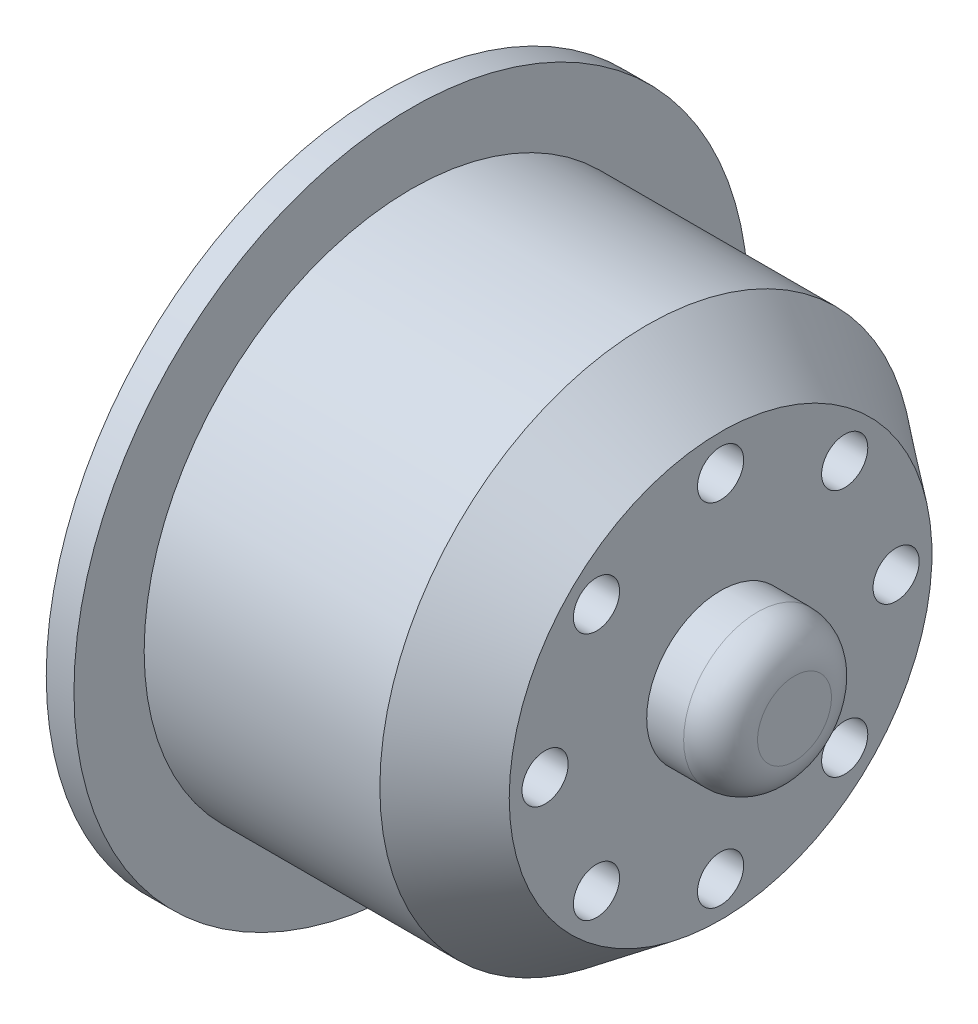
ISO-10303-21;
HEADER;
FILE_DESCRIPTION(('STEP AP214'),'2;1');
FILE_NAME('part.step','',(''),(''),'','','');
FILE_SCHEMA(('AUTOMOTIVE_DESIGN { 1 0 10303 214 1 1 1 1 }'));
ENDSEC;
DATA;
#1=APPLICATION_CONTEXT('core data for automotive mechanical design processes');
#2=APPLICATION_PROTOCOL_DEFINITION('international standard','automotive_design',2000,#1);
#3=PRODUCT_CONTEXT('',#1,'mechanical');
#4=PRODUCT('Part','Part','',(#3));
#5=PRODUCT_RELATED_PRODUCT_CATEGORY('part','',(#4));
#6=PRODUCT_DEFINITION_FORMATION('','',#4);
#7=PRODUCT_DEFINITION_CONTEXT('part definition',#1,'design');
#8=PRODUCT_DEFINITION('design','',#6,#7);
#9=PRODUCT_DEFINITION_SHAPE('','',#8);
#10=(LENGTH_UNIT() NAMED_UNIT(*) SI_UNIT(.MILLI.,.METRE.));
#11=(NAMED_UNIT(*) PLANE_ANGLE_UNIT() SI_UNIT($,.RADIAN.));
#12=(NAMED_UNIT(*) SI_UNIT($,.STERADIAN.) SOLID_ANGLE_UNIT());
#13=UNCERTAINTY_MEASURE_WITH_UNIT(LENGTH_MEASURE(1.E-05),#10,'distance_accuracy_value','');
#14=(GEOMETRIC_REPRESENTATION_CONTEXT(3) GLOBAL_UNCERTAINTY_ASSIGNED_CONTEXT((#13)) GLOBAL_UNIT_ASSIGNED_CONTEXT((#10,
#11,#12)) REPRESENTATION_CONTEXT('',''));
#15=CARTESIAN_POINT('',(0.,0.,0.));
#16=DIRECTION('',(0.,0.,1.));
#17=DIRECTION('',(1.,0.,0.));
#18=AXIS2_PLACEMENT_3D('',#15,#16,#17);
#19=CARTESIAN_POINT('',(-7.6304347826087,6.71751442127166,6.71751442127198));
#20=DIRECTION('',(1.,0.,0.));
#21=DIRECTION('',(0.,0.,-1.));
#22=AXIS2_PLACEMENT_3D('',#19,#20,#21);
#23=CYLINDRICAL_SURFACE('',#22,1.25);
#24=CARTESIAN_POINT('',(10.6195652173913,6.71751442127166,6.71751442127198));
#25=DIRECTION('',(1.,0.,0.));
#26=DIRECTION('',(0.,0.,-1.));
#27=AXIS2_PLACEMENT_3D('',#24,#25,#26);
#28=CIRCLE('',#27,1.25);
#29=CARTESIAN_POINT('',(10.6195652173913,6.71751442127166,5.46751442127198));
#30=VERTEX_POINT('',#29);
#31=EDGE_CURVE('E271',#30,#30,#28,.T.);
#32=ORIENTED_EDGE('',*,*,#31,.T.);
#33=EDGE_LOOP('',(#32));
#34=FACE_BOUND('',#33,.T.);
#35=CARTESIAN_POINT('',(5.61956521739131,6.71751442127166,6.71751442127198));
#36=DIRECTION('',(-1.,0.,0.));
#37=DIRECTION('',(0.,0.,1.));
#38=AXIS2_PLACEMENT_3D('',#35,#36,#37);
#39=CIRCLE('',#38,1.25);
#40=CARTESIAN_POINT('',(5.61956521739131,6.71751442127166,7.96751442127198));
#41=VERTEX_POINT('',#40);
#42=EDGE_CURVE('E275',#41,#41,#39,.F.);
#43=ORIENTED_EDGE('',*,*,#42,.F.);
#44=EDGE_LOOP('',(#43));
#45=FACE_BOUND('',#44,.T.);
#46=ADVANCED_FACE('F41',(#34,#45),#23,.F.);
#47=CARTESIAN_POINT('',(-7.6304347826087,-7.66926912071228E-13,9.49999999999923));
#48=DIRECTION('',(1.,0.,0.));
#49=DIRECTION('',(0.,0.,-1.));
#50=AXIS2_PLACEMENT_3D('',#47,#48,#49);
#51=CYLINDRICAL_SURFACE('',#50,1.25);
#52=CARTESIAN_POINT('',(10.6195652173913,-7.66926912071228E-13,9.49999999999923));
#53=DIRECTION('',(1.,0.,0.));
#54=DIRECTION('',(0.,0.,-1.));
#55=AXIS2_PLACEMENT_3D('',#52,#53,#54);
#56=CIRCLE('',#55,1.25);
#57=CARTESIAN_POINT('',(10.6195652173913,-7.66926912071228E-13,8.24999999999924));
#58=VERTEX_POINT('',#57);
#59=EDGE_CURVE('E267',#58,#58,#56,.T.);
#60=ORIENTED_EDGE('',*,*,#59,.T.);
#61=EDGE_LOOP('',(#60));
#62=FACE_BOUND('',#61,.T.);
#63=CARTESIAN_POINT('',(5.61956521739131,-7.66926912071228E-13,9.49999999999923));
#64=DIRECTION('',(-1.,0.,0.));
#65=DIRECTION('',(0.,0.,1.));
#66=AXIS2_PLACEMENT_3D('',#63,#64,#65);
#67=CIRCLE('',#66,1.25);
#68=CARTESIAN_POINT('',(5.61956521739131,-7.66926912071228E-13,10.7499999999992));
#69=VERTEX_POINT('',#68);
#70=EDGE_CURVE('E331',#69,#69,#67,.F.);
#71=ORIENTED_EDGE('',*,*,#70,.F.);
#72=EDGE_LOOP('',(#71));
#73=FACE_BOUND('',#72,.T.);
#74=ADVANCED_FACE('F438',(#62,#73),#51,.F.);
#75=CARTESIAN_POINT('',(-7.6304347826087,-6.71751442127274,6.7175144212709));
#76=DIRECTION('',(1.,0.,0.));
#77=DIRECTION('',(0.,0.,-1.));
#78=AXIS2_PLACEMENT_3D('',#75,#76,#77);
#79=CYLINDRICAL_SURFACE('',#78,1.25);
#80=CARTESIAN_POINT('',(10.6195652173913,-6.71751442127274,6.7175144212709));
#81=DIRECTION('',(1.,0.,0.));
#82=DIRECTION('',(0.,0.,-1.));
#83=AXIS2_PLACEMENT_3D('',#80,#81,#82);
#84=CIRCLE('',#83,1.25);
#85=CARTESIAN_POINT('',(10.6195652173913,-6.71751442127274,5.4675144212709));
#86=VERTEX_POINT('',#85);
#87=EDGE_CURVE('E263',#86,#86,#84,.T.);
#88=ORIENTED_EDGE('',*,*,#87,.T.);
#89=EDGE_LOOP('',(#88));
#90=FACE_BOUND('',#89,.T.);
#91=CARTESIAN_POINT('',(5.61956521739131,-6.71751442127274,6.7175144212709));
#92=DIRECTION('',(-1.,0.,0.));
#93=DIRECTION('',(0.,0.,1.));
#94=AXIS2_PLACEMENT_3D('',#91,#92,#93);
#95=CIRCLE('',#94,1.25);
#96=CARTESIAN_POINT('',(5.61956521739131,-6.71751442127274,7.9675144212709));
#97=VERTEX_POINT('',#96);
#98=EDGE_CURVE('E327',#97,#97,#95,.F.);
#99=ORIENTED_EDGE('',*,*,#98,.F.);
#100=EDGE_LOOP('',(#99));
#101=FACE_BOUND('',#100,.T.);
#102=ADVANCED_FACE('F444',(#90,#101),#79,.F.);
#103=CARTESIAN_POINT('',(-7.6304347826087,-9.5,-1.53152699522408E-12));
#104=DIRECTION('',(1.,0.,0.));
#105=DIRECTION('',(0.,0.,-1.));
#106=AXIS2_PLACEMENT_3D('',#103,#104,#105);
#107=CYLINDRICAL_SURFACE('',#106,1.25);
#108=CARTESIAN_POINT('',(10.6195652173913,-9.5,-1.53152699522408E-12));
#109=DIRECTION('',(1.,0.,0.));
#110=DIRECTION('',(0.,0.,-1.));
#111=AXIS2_PLACEMENT_3D('',#108,#109,#110);
#112=CIRCLE('',#111,1.25);
#113=CARTESIAN_POINT('',(10.6195652173913,-9.5,-1.25000000000153));
#114=VERTEX_POINT('',#113);
#115=EDGE_CURVE('E259',#114,#114,#112,.T.);
#116=ORIENTED_EDGE('',*,*,#115,.T.);
#117=EDGE_LOOP('',(#116));
#118=FACE_BOUND('',#117,.T.);
#119=CARTESIAN_POINT('',(5.61956521739131,-9.5,-1.53152699522408E-12));
#120=DIRECTION('',(-1.,0.,0.));
#121=DIRECTION('',(0.,0.,1.));
#122=AXIS2_PLACEMENT_3D('',#119,#120,#121);
#123=CIRCLE('',#122,1.25);
#124=CARTESIAN_POINT('',(5.61956521739131,-9.5,1.24999999999847));
#125=VERTEX_POINT('',#124);
#126=EDGE_CURVE('E323',#125,#125,#123,.F.);
#127=ORIENTED_EDGE('',*,*,#126,.F.);
#128=EDGE_LOOP('',(#127));
#129=FACE_BOUND('',#128,.T.);
#130=ADVANCED_FACE('F513',(#118,#129),#107,.F.);
#131=CARTESIAN_POINT('',(-7.6304347826087,-6.71751442127166,-6.71751442127351));
#132=DIRECTION('',(1.,0.,0.));
#133=DIRECTION('',(0.,0.,-1.));
#134=AXIS2_PLACEMENT_3D('',#131,#132,#133);
#135=CYLINDRICAL_SURFACE('',#134,1.25);
#136=CARTESIAN_POINT('',(10.6195652173913,-6.71751442127166,-6.71751442127351));
#137=DIRECTION('',(1.,0.,0.));
#138=DIRECTION('',(0.,0.,-1.));
#139=AXIS2_PLACEMENT_3D('',#136,#137,#138);
#140=CIRCLE('',#139,1.25);
#141=CARTESIAN_POINT('',(10.6195652173913,-6.71751442127166,-7.96751442127351));
#142=VERTEX_POINT('',#141);
#143=EDGE_CURVE('E255',#142,#142,#140,.T.);
#144=ORIENTED_EDGE('',*,*,#143,.T.);
#145=EDGE_LOOP('',(#144));
#146=FACE_BOUND('',#145,.T.);
#147=CARTESIAN_POINT('',(5.61956521739131,-6.71751442127166,-6.71751442127351));
#148=DIRECTION('',(-1.,0.,0.));
#149=DIRECTION('',(0.,0.,1.));
#150=AXIS2_PLACEMENT_3D('',#147,#148,#149);
#151=CIRCLE('',#150,1.25);
#152=CARTESIAN_POINT('',(5.61956521739131,-6.71751442127166,-5.46751442127351));
#153=VERTEX_POINT('',#152);
#154=EDGE_CURVE('E319',#153,#153,#151,.F.);
#155=ORIENTED_EDGE('',*,*,#154,.F.);
#156=EDGE_LOOP('',(#155));
#157=FACE_BOUND('',#156,.T.);
#158=ADVANCED_FACE('F509',(#146,#157),#135,.F.);
#159=CARTESIAN_POINT('',(-7.6304347826087,7.65763497612038E-13,-9.50000000000077));
#160=DIRECTION('',(1.,0.,0.));
#161=DIRECTION('',(0.,0.,-1.));
#162=AXIS2_PLACEMENT_3D('',#159,#160,#161);
#163=CYLINDRICAL_SURFACE('',#162,1.25);
#164=CARTESIAN_POINT('',(10.6195652173913,7.65763497612038E-13,-9.50000000000077));
#165=DIRECTION('',(1.,0.,0.));
#166=DIRECTION('',(0.,0.,-1.));
#167=AXIS2_PLACEMENT_3D('',#164,#165,#166);
#168=CIRCLE('',#167,1.25);
#169=CARTESIAN_POINT('',(10.6195652173913,7.65763497612038E-13,-10.7500000000008));
#170=VERTEX_POINT('',#169);
#171=EDGE_CURVE('E251',#170,#170,#168,.T.);
#172=ORIENTED_EDGE('',*,*,#171,.T.);
#173=EDGE_LOOP('',(#172));
#174=FACE_BOUND('',#173,.T.);
#175=CARTESIAN_POINT('',(5.61956521739131,7.65763497612038E-13,-9.50000000000077));
#176=DIRECTION('',(-1.,0.,0.));
#177=DIRECTION('',(0.,0.,1.));
#178=AXIS2_PLACEMENT_3D('',#175,#176,#177);
#179=CIRCLE('',#178,1.25);
#180=CARTESIAN_POINT('',(5.61956521739131,7.65763497612038E-13,-8.25000000000077));
#181=VERTEX_POINT('',#180);
#182=EDGE_CURVE('E315',#181,#181,#179,.F.);
#183=ORIENTED_EDGE('',*,*,#182,.F.);
#184=EDGE_LOOP('',(#183));
#185=FACE_BOUND('',#184,.T.);
#186=ADVANCED_FACE('F499',(#174,#185),#163,.F.);
#187=CARTESIAN_POINT('',(-7.6304347826087,6.71751442127274,-6.71751442127242));
#188=DIRECTION('',(1.,0.,0.));
#189=DIRECTION('',(0.,0.,-1.));
#190=AXIS2_PLACEMENT_3D('',#187,#188,#189);
#191=CYLINDRICAL_SURFACE('',#190,1.25);
#192=CARTESIAN_POINT('',(10.6195652173913,6.71751442127274,-6.71751442127242));
#193=DIRECTION('',(1.,0.,0.));
#194=DIRECTION('',(0.,0.,-1.));
#195=AXIS2_PLACEMENT_3D('',#192,#193,#194);
#196=CIRCLE('',#195,1.25);
#197=CARTESIAN_POINT('',(10.6195652173913,6.71751442127274,-7.96751442127243));
#198=VERTEX_POINT('',#197);
#199=EDGE_CURVE('E247',#198,#198,#196,.T.);
#200=ORIENTED_EDGE('',*,*,#199,.T.);
#201=EDGE_LOOP('',(#200));
#202=FACE_BOUND('',#201,.T.);
#203=CARTESIAN_POINT('',(5.61956521739131,6.71751442127274,-6.71751442127242));
#204=DIRECTION('',(-1.,0.,0.));
#205=DIRECTION('',(0.,0.,1.));
#206=AXIS2_PLACEMENT_3D('',#203,#204,#205);
#207=CIRCLE('',#206,1.25);
#208=CARTESIAN_POINT('',(5.61956521739131,6.71751442127274,-5.46751442127242));
#209=VERTEX_POINT('',#208);
#210=EDGE_CURVE('E311',#209,#209,#207,.F.);
#211=ORIENTED_EDGE('',*,*,#210,.F.);
#212=EDGE_LOOP('',(#211));
#213=FACE_BOUND('',#212,.T.);
#214=ADVANCED_FACE('F481',(#202,#213),#191,.F.);
#215=CARTESIAN_POINT('',(-7.6304347826087,9.5,0.));
#216=DIRECTION('',(1.,0.,0.));
#217=DIRECTION('',(0.,0.,-1.));
#218=AXIS2_PLACEMENT_3D('',#215,#216,#217);
#219=CYLINDRICAL_SURFACE('',#218,1.25);
#220=CARTESIAN_POINT('',(10.6195652173913,9.5,0.));
#221=DIRECTION('',(1.,0.,0.));
#222=DIRECTION('',(0.,0.,-1.));
#223=AXIS2_PLACEMENT_3D('',#220,#221,#222);
#224=CIRCLE('',#223,1.25);
#225=CARTESIAN_POINT('',(10.6195652173913,9.5,-1.25));
#226=VERTEX_POINT('',#225);
#227=EDGE_CURVE('E242',#226,#226,#224,.T.);
#228=ORIENTED_EDGE('',*,*,#227,.T.);
#229=EDGE_LOOP('',(#228));
#230=FACE_BOUND('',#229,.T.);
#231=CARTESIAN_POINT('',(5.61956521739131,9.5,0.));
#232=DIRECTION('',(-1.,0.,0.));
#233=DIRECTION('',(0.,0.,1.));
#234=AXIS2_PLACEMENT_3D('',#231,#232,#233);
#235=CIRCLE('',#234,1.25);
#236=CARTESIAN_POINT('',(5.61956521739131,9.5,1.25));
#237=VERTEX_POINT('',#236);
#238=EDGE_CURVE('E241',#237,#237,#235,.F.);
#239=ORIENTED_EDGE('',*,*,#238,.F.);
#240=EDGE_LOOP('',(#239));
#241=FACE_BOUND('',#240,.T.);
#242=ADVANCED_FACE('F476',(#230,#241),#219,.F.);
#243=CARTESIAN_POINT('',(-6.1304347826087,0.,-14.45));
#244=DIRECTION('',(-1.,0.,0.));
#245=DIRECTION('',(0.,0.,1.));
#246=AXIS2_PLACEMENT_3D('',#243,#244,#245);
#247=PLANE('',#246);
#248=CARTESIAN_POINT('',(-6.1304347826087,0.,0.));
#249=DIRECTION('',(-1.,0.,0.));
#250=DIRECTION('',(0.,0.,1.));
#251=AXIS2_PLACEMENT_3D('',#248,#249,#250);
#252=CIRCLE('',#251,18.25);
#253=CARTESIAN_POINT('',(-6.1304347826087,0.,18.25));
#254=VERTEX_POINT('',#253);
#255=EDGE_CURVE('E295',#254,#254,#252,.T.);
#256=ORIENTED_EDGE('',*,*,#255,.F.);
#257=EDGE_LOOP('',(#256));
#258=FACE_BOUND('',#257,.T.);
#259=CARTESIAN_POINT('',(-6.1304347826087,0.,0.));
#260=DIRECTION('',(-1.,0.,0.));
#261=DIRECTION('',(0.,0.,1.));
#262=AXIS2_PLACEMENT_3D('',#259,#260,#261);
#263=CIRCLE('',#262,14.45);
#264=CARTESIAN_POINT('',(-6.1304347826087,0.,14.45));
#265=VERTEX_POINT('',#264);
#266=EDGE_CURVE('E246',#265,#265,#263,.T.);
#267=ORIENTED_EDGE('',*,*,#266,.T.);
#268=EDGE_LOOP('',(#267));
#269=FACE_BOUND('',#268,.T.);
#270=ADVANCED_FACE('F473',(#258,#269),#247,.F.);
#271=CARTESIAN_POINT('',(-12.3913043478261,0.,0.));
#272=DIRECTION('',(-1.,0.,0.));
#273=DIRECTION('',(0.,0.,1.));
#274=AXIS2_PLACEMENT_3D('',#271,#272,#273);
#275=CYLINDRICAL_SURFACE('',#274,18.25);
#276=CARTESIAN_POINT('',(-7.6304347826087,0.,0.));
#277=DIRECTION('',(-1.,0.,0.));
#278=DIRECTION('',(0.,0.,1.));
#279=AXIS2_PLACEMENT_3D('',#276,#277,#278);
#280=CIRCLE('',#279,18.25);
#281=CARTESIAN_POINT('',(-7.6304347826087,0.,18.25));
#282=VERTEX_POINT('',#281);
#283=EDGE_CURVE('E291',#282,#282,#280,.T.);
#284=ORIENTED_EDGE('',*,*,#283,.F.);
#285=EDGE_LOOP('',(#284));
#286=FACE_BOUND('',#285,.T.);
#287=ORIENTED_EDGE('',*,*,#255,.T.);
#288=EDGE_LOOP('',(#287));
#289=FACE_BOUND('',#288,.T.);
#290=ADVANCED_FACE('F471',(#286,#289),#275,.T.);
#291=CARTESIAN_POINT('',(-7.6304347826087,0.,-18.25));
#292=DIRECTION('',(1.,0.,0.));
#293=DIRECTION('',(0.,0.,-1.));
#294=AXIS2_PLACEMENT_3D('',#291,#292,#293);
#295=PLANE('',#294);
#296=CARTESIAN_POINT('',(-7.6304347826087,-8.09437011536873E-13,-9.49999999999865));
#297=DIRECTION('',(-1.,0.,0.));
#298=DIRECTION('',(0.,0.,1.));
#299=AXIS2_PLACEMENT_3D('',#296,#297,#298);
#300=CIRCLE('',#299,2.5000000000011);
#301=CARTESIAN_POINT('',(-7.6304347826087,2.14178841572339,-10.7894736842106));
#302=VERTEX_POINT('',#301);
#303=CARTESIAN_POINT('',(-7.6304347826087,-2.14178841572523,-10.7894736842102));
#304=VERTEX_POINT('',#303);
#305=EDGE_CURVE('E217',#302,#304,#300,.T.);
#306=ORIENTED_EDGE('',*,*,#305,.F.);
#307=CARTESIAN_POINT('',(-7.6304347826087,0.,0.));
#308=DIRECTION('',(-1.,0.,0.));
#309=DIRECTION('',(0.,0.,1.));
#310=AXIS2_PLACEMENT_3D('',#307,#308,#309);
#311=CIRCLE('',#310,11.);
#312=CARTESIAN_POINT('',(-7.6304347826087,6.11483689491384,-9.14378312016424));
#313=VERTEX_POINT('',#312);
#314=EDGE_CURVE('E355',#313,#302,#311,.T.);
#315=ORIENTED_EDGE('',*,*,#314,.F.);
#316=CARTESIAN_POINT('',(-7.6304347826087,6.71751442127125,-6.71751442127159));
#317=DIRECTION('',(-1.,0.,0.));
#318=DIRECTION('',(0.,0.,1.));
#319=AXIS2_PLACEMENT_3D('',#316,#317,#318);
#320=CIRCLE('',#319,2.50000000000051);
#321=CARTESIAN_POINT('',(-7.6304347826087,9.14378312016393,-6.1148368949143));
#322=VERTEX_POINT('',#321);
#323=EDGE_CURVE('E225',#322,#313,#320,.T.);
#324=ORIENTED_EDGE('',*,*,#323,.F.);
#325=CARTESIAN_POINT('',(-7.6304347826087,10.7894736842106,-2.1417884157234));
#326=VERTEX_POINT('',#325);
#327=EDGE_CURVE('E353',#326,#322,#311,.T.);
#328=ORIENTED_EDGE('',*,*,#327,.F.);
#329=CARTESIAN_POINT('',(-7.6304347826087,9.49999999999946,0.));
#330=DIRECTION('',(-1.,0.,0.));
#331=DIRECTION('',(0.,0.,1.));
#332=AXIS2_PLACEMENT_3D('',#329,#330,#331);
#333=CIRCLE('',#332,2.5);
#334=CARTESIAN_POINT('',(-7.6304347826087,10.7894736842106,2.1417884157234));
#335=VERTEX_POINT('',#334);
#336=EDGE_CURVE('E233',#335,#326,#333,.T.);
#337=ORIENTED_EDGE('',*,*,#336,.F.);
#338=CARTESIAN_POINT('',(-7.6304347826087,9.14378312016436,6.11483689491366));
#339=VERTEX_POINT('',#338);
#340=EDGE_CURVE('E178',#339,#335,#311,.T.);
#341=ORIENTED_EDGE('',*,*,#340,.F.);
#342=CARTESIAN_POINT('',(-7.6304347826087,6.71751442127239,6.71751442127206));
#343=DIRECTION('',(-1.,0.,0.));
#344=DIRECTION('',(0.,0.,1.));
#345=AXIS2_PLACEMENT_3D('',#342,#343,#344);
#346=CIRCLE('',#345,2.50000000000008);
#347=CARTESIAN_POINT('',(-7.6304347826087,6.11483689491412,9.14378312016405));
#348=VERTEX_POINT('',#347);
#349=EDGE_CURVE('E175',#348,#339,#346,.T.);
#350=ORIENTED_EDGE('',*,*,#349,.F.);
#351=CARTESIAN_POINT('',(-7.6304347826087,2.14178841572562,10.7894736842102));
#352=VERTEX_POINT('',#351);
#353=EDGE_CURVE('E158',#352,#348,#311,.T.);
#354=ORIENTED_EDGE('',*,*,#353,.F.);
#355=CARTESIAN_POINT('',(-7.6304347826087,8.08273597077683E-13,9.50000000000027));
#356=DIRECTION('',(-1.,0.,0.));
#357=DIRECTION('',(0.,0.,1.));
#358=AXIS2_PLACEMENT_3D('',#355,#356,#357);
#359=CIRCLE('',#358,2.50000000000057);
#360=CARTESIAN_POINT('',(-7.6304347826087,-2.14178841572378,10.7894736842105));
#361=VERTEX_POINT('',#360);
#362=EDGE_CURVE('E172',#361,#352,#359,.T.);
#363=ORIENTED_EDGE('',*,*,#362,.F.);
#364=CARTESIAN_POINT('',(-7.6304347826087,-6.1148368949113,9.14378312016594));
#365=VERTEX_POINT('',#364);
#366=EDGE_CURVE('E180',#365,#361,#311,.T.);
#367=ORIENTED_EDGE('',*,*,#366,.F.);
#368=CARTESIAN_POINT('',(-7.6304347826087,-6.71751442127125,6.7175144212732));
#369=DIRECTION('',(-1.,0.,0.));
#370=DIRECTION('',(0.,0.,1.));
#371=AXIS2_PLACEMENT_3D('',#368,#369,#370);
#372=CIRCLE('',#371,2.5000000000012);
#373=CARTESIAN_POINT('',(-7.6304347826087,-9.14378312016416,6.11483689491395));
#374=VERTEX_POINT('',#373);
#375=EDGE_CURVE('E191',#374,#365,#372,.T.);
#376=ORIENTED_EDGE('',*,*,#375,.F.);
#377=CARTESIAN_POINT('',(-7.6304347826087,-10.7894736842098,2.14178841572737));
#378=VERTEX_POINT('',#377);
#379=EDGE_CURVE('E621',#378,#374,#311,.T.);
#380=ORIENTED_EDGE('',*,*,#379,.F.);
#381=CARTESIAN_POINT('',(-7.6304347826087,-9.49999999999946,1.61654719415537E-12));
#382=DIRECTION('',(-1.,0.,0.));
#383=DIRECTION('',(0.,0.,1.));
#384=AXIS2_PLACEMENT_3D('',#381,#382,#383);
#385=CIRCLE('',#384,2.50000000000161);
#386=CARTESIAN_POINT('',(-7.6304347826087,-10.7894736842105,-2.1417884157237));
#387=VERTEX_POINT('',#386);
#388=EDGE_CURVE('E201',#387,#378,#385,.T.);
#389=ORIENTED_EDGE('',*,*,#388,.F.);
#390=CARTESIAN_POINT('',(-7.6304347826087,-9.14378312016577,-6.11483689491155));
#391=VERTEX_POINT('',#390);
#392=EDGE_CURVE('E624',#391,#387,#311,.T.);
#393=ORIENTED_EDGE('',*,*,#392,.F.);
#394=CARTESIAN_POINT('',(-7.6304347826087,-6.71751442127239,-6.71751442127044));
#395=DIRECTION('',(-1.,0.,0.));
#396=DIRECTION('',(0.,0.,1.));
#397=AXIS2_PLACEMENT_3D('',#394,#395,#396);
#398=CIRCLE('',#397,2.50000000000157);
#399=CARTESIAN_POINT('',(-7.6304347826087,-6.11483689491421,-9.14378312016399));
#400=VERTEX_POINT('',#399);
#401=EDGE_CURVE('E209',#400,#391,#398,.T.);
#402=ORIENTED_EDGE('',*,*,#401,.F.);
#403=EDGE_CURVE('E627',#304,#400,#311,.T.);
#404=ORIENTED_EDGE('',*,*,#403,.F.);
#405=EDGE_LOOP('',(#306,#315,#324,#328,#337,#341,#350,#354,#363,#367,#376,#380,#389,#393,#402,#404));
#406=FACE_BOUND('',#405,.T.);
#407=ORIENTED_EDGE('',*,*,#283,.T.);
#408=EDGE_LOOP('',(#407));
#409=FACE_BOUND('',#408,.T.);
#410=ADVANCED_FACE('F169',(#406,#409),#295,.F.);
#411=CARTESIAN_POINT('',(14.6195652173913,0.,-4.));
#412=DIRECTION('',(-1.,0.,0.));
#413=DIRECTION('',(0.,0.,1.));
#414=AXIS2_PLACEMENT_3D('',#411,#412,#413);
#415=PLANE('',#414);
#416=CARTESIAN_POINT('',(14.6195652173913,0.,0.));
#417=DIRECTION('',(-1.,0.,0.));
#418=DIRECTION('',(0.,0.,1.));
#419=AXIS2_PLACEMENT_3D('',#416,#417,#418);
#420=CIRCLE('',#419,2.);
#421=CARTESIAN_POINT('',(14.6195652173913,0.,2.));
#422=VERTEX_POINT('',#421);
#423=EDGE_CURVE('E303',#422,#422,#420,.F.);
#424=ORIENTED_EDGE('',*,*,#423,.T.);
#425=EDGE_LOOP('',(#424));
#426=FACE_BOUND('',#425,.T.);
#427=ADVANCED_FACE('F464',(#426),#415,.F.);
#428=CARTESIAN_POINT('',(-12.3913043478261,0.,0.));
#429=DIRECTION('',(-1.,0.,0.));
#430=DIRECTION('',(0.,0.,1.));
#431=AXIS2_PLACEMENT_3D('',#428,#429,#430);
#432=CYLINDRICAL_SURFACE('',#431,4.);
#433=CARTESIAN_POINT('',(12.6195652173913,0.,0.));
#434=DIRECTION('',(-1.,0.,0.));
#435=DIRECTION('',(0.,0.,1.));
#436=AXIS2_PLACEMENT_3D('',#433,#434,#435);
#437=CIRCLE('',#436,4.);
#438=CARTESIAN_POINT('',(12.6195652173913,0.,4.));
#439=VERTEX_POINT('',#438);
#440=EDGE_CURVE('E299',#439,#439,#437,.T.);
#441=ORIENTED_EDGE('',*,*,#440,.T.);
#442=EDGE_LOOP('',(#441));
#443=FACE_BOUND('',#442,.T.);
#444=CARTESIAN_POINT('',(10.6195652173913,0.,0.));
#445=DIRECTION('',(-1.,0.,0.));
#446=DIRECTION('',(0.,0.,1.));
#447=AXIS2_PLACEMENT_3D('',#444,#445,#446);
#448=CIRCLE('',#447,4.);
#449=CARTESIAN_POINT('',(10.6195652173913,0.,4.));
#450=VERTEX_POINT('',#449);
#451=EDGE_CURVE('E287',#450,#450,#448,.T.);
#452=ORIENTED_EDGE('',*,*,#451,.F.);
#453=EDGE_LOOP('',(#452));
#454=FACE_BOUND('',#453,.T.);
#455=ADVANCED_FACE('F460',(#443,#454),#432,.T.);
#456=CARTESIAN_POINT('',(10.6195652173913,0.,-11.4409248842397));
#457=DIRECTION('',(-1.,0.,0.));
#458=DIRECTION('',(0.,0.,1.));
#459=AXIS2_PLACEMENT_3D('',#456,#457,#458);
#460=PLANE('',#459);
#461=ORIENTED_EDGE('',*,*,#227,.F.);
#462=EDGE_LOOP('',(#461));
#463=FACE_BOUND('',#462,.T.);
#464=ORIENTED_EDGE('',*,*,#199,.F.);
#465=EDGE_LOOP('',(#464));
#466=FACE_BOUND('',#465,.T.);
#467=ORIENTED_EDGE('',*,*,#171,.F.);
#468=EDGE_LOOP('',(#467));
#469=FACE_BOUND('',#468,.T.);
#470=ORIENTED_EDGE('',*,*,#143,.F.);
#471=EDGE_LOOP('',(#470));
#472=FACE_BOUND('',#471,.T.);
#473=ORIENTED_EDGE('',*,*,#115,.F.);
#474=EDGE_LOOP('',(#473));
#475=FACE_BOUND('',#474,.T.);
#476=ORIENTED_EDGE('',*,*,#87,.F.);
#477=EDGE_LOOP('',(#476));
#478=FACE_BOUND('',#477,.T.);
#479=ORIENTED_EDGE('',*,*,#59,.F.);
#480=EDGE_LOOP('',(#479));
#481=FACE_BOUND('',#480,.T.);
#482=ORIENTED_EDGE('',*,*,#31,.F.);
#483=EDGE_LOOP('',(#482));
#484=FACE_BOUND('',#483,.T.);
#485=CARTESIAN_POINT('',(10.6195652173913,0.,0.));
#486=DIRECTION('',(-1.,0.,0.));
#487=DIRECTION('',(0.,0.,1.));
#488=AXIS2_PLACEMENT_3D('',#485,#486,#487);
#489=CIRCLE('',#488,11.4409248842397);
#490=CARTESIAN_POINT('',(10.6195652173913,0.,11.4409248842397));
#491=VERTEX_POINT('',#490);
#492=EDGE_CURVE('E283',#491,#491,#489,.T.);
#493=ORIENTED_EDGE('',*,*,#492,.F.);
#494=EDGE_LOOP('',(#493));
#495=FACE_BOUND('',#494,.T.);
#496=ORIENTED_EDGE('',*,*,#451,.T.);
#497=EDGE_LOOP('',(#496));
#498=FACE_BOUND('',#497,.T.);
#499=ADVANCED_FACE('F456',(#463,#466,#469,#472,#475,#478,#481,#484,#495,#498),#460,.F.);
#500=CARTESIAN_POINT('',(10.6195652173913,0.,0.));
#501=DIRECTION('',(-1.,0.,0.));
#502=DIRECTION('',(0.,0.,1.));
#503=AXIS2_PLACEMENT_3D('',#500,#501,#502);
#504=CONICAL_SURFACE('',#503,11.4409248842397,0.645771823237905);
#505=CARTESIAN_POINT('',(6.62638766715485,0.,0.));
#506=DIRECTION('',(-1.,0.,0.));
#507=DIRECTION('',(0.,0.,1.));
#508=AXIS2_PLACEMENT_3D('',#505,#506,#507);
#509=CIRCLE('',#508,14.45);
#510=CARTESIAN_POINT('',(6.62638766715485,0.,14.45));
#511=VERTEX_POINT('',#510);
#512=EDGE_CURVE('E279',#511,#511,#509,.T.);
#513=ORIENTED_EDGE('',*,*,#512,.F.);
#514=EDGE_LOOP('',(#513));
#515=FACE_BOUND('',#514,.T.);
#516=ORIENTED_EDGE('',*,*,#492,.T.);
#517=EDGE_LOOP('',(#516));
#518=FACE_BOUND('',#517,.T.);
#519=ADVANCED_FACE('F452',(#515,#518),#504,.T.);
#520=CARTESIAN_POINT('',(-12.3913043478261,0.,0.));
#521=DIRECTION('',(-1.,0.,0.));
#522=DIRECTION('',(0.,0.,1.));
#523=AXIS2_PLACEMENT_3D('',#520,#521,#522);
#524=CYLINDRICAL_SURFACE('',#523,14.45);
#525=ORIENTED_EDGE('',*,*,#266,.F.);
#526=EDGE_LOOP('',(#525));
#527=FACE_BOUND('',#526,.T.);
#528=ORIENTED_EDGE('',*,*,#512,.T.);
#529=EDGE_LOOP('',(#528));
#530=FACE_BOUND('',#529,.T.);
#531=ADVANCED_FACE('F449',(#527,#530),#524,.T.);
#532=CARTESIAN_POINT('',(12.6195652173913,0.,0.));
#533=DIRECTION('',(-1.,0.,0.));
#534=DIRECTION('',(0.,0.,1.));
#535=AXIS2_PLACEMENT_3D('',#532,#533,#534);
#536=DEGENERATE_TOROIDAL_SURFACE('',#535,2.,2.,.T.);
#537=ORIENTED_EDGE('',*,*,#423,.F.);
#538=EDGE_LOOP('',(#537));
#539=FACE_BOUND('',#538,.T.);
#540=ORIENTED_EDGE('',*,*,#440,.F.);
#541=EDGE_LOOP('',(#540));
#542=FACE_BOUND('',#541,.T.);
#543=ADVANCED_FACE('F43',(#539,#542),#536,.T.);
#544=CARTESIAN_POINT('',(5.61956521739131,0.,-11.4409248842397));
#545=DIRECTION('',(-1.,0.,0.));
#546=DIRECTION('',(0.,0.,1.));
#547=AXIS2_PLACEMENT_3D('',#544,#545,#546);
#548=PLANE('',#547);
#549=CARTESIAN_POINT('',(5.61956521739131,9.49999999999946,0.));
#550=DIRECTION('',(-1.,0.,0.));
#551=DIRECTION('',(0.,0.,1.));
#552=AXIS2_PLACEMENT_3D('',#549,#550,#551);
#553=CIRCLE('',#552,2.5);
#554=CARTESIAN_POINT('',(5.61956521739131,9.49999999999946,2.5));
#555=VERTEX_POINT('',#554);
#556=EDGE_CURVE('E237',#555,#555,#553,.F.);
#557=ORIENTED_EDGE('',*,*,#556,.F.);
#558=EDGE_LOOP('',(#557));
#559=FACE_BOUND('',#558,.T.);
#560=ORIENTED_EDGE('',*,*,#238,.T.);
#561=EDGE_LOOP('',(#560));
#562=FACE_BOUND('',#561,.T.);
#563=ADVANCED_FACE('F571',(#559,#562),#548,.T.);
#564=CARTESIAN_POINT('',(17.6906330292613,9.49999999999946,0.));
#565=DIRECTION('',(-1.,0.,0.));
#566=DIRECTION('',(0.,0.,1.));
#567=AXIS2_PLACEMENT_3D('',#564,#565,#566);
#568=CYLINDRICAL_SURFACE('',#567,2.5);
#569=ORIENTED_EDGE('',*,*,#556,.T.);
#570=EDGE_LOOP('',(#569));
#571=FACE_BOUND('',#570,.T.);
#572=CARTESIAN_POINT('',(-1.6304347826087,9.49999999999946,0.));
#573=DIRECTION('',(-1.,0.,0.));
#574=DIRECTION('',(0.,0.,1.));
#575=AXIS2_PLACEMENT_3D('',#572,#573,#574);
#576=CIRCLE('',#575,2.5);
#577=CARTESIAN_POINT('',(-1.6304347826087,10.7894736842106,2.1417884157234));
#578=VERTEX_POINT('',#577);
#579=CARTESIAN_POINT('',(-1.6304347826087,10.7894736842106,-2.1417884157234));
#580=VERTEX_POINT('',#579);
#581=EDGE_CURVE('E163',#578,#580,#576,.F.);
#582=ORIENTED_EDGE('',*,*,#581,.F.);
#583=DIRECTION('',(-1.,0.,0.));
#584=VECTOR('',#583,1.);
#585=CARTESIAN_POINT('',(-4.6304347826087,10.7894736842106,2.1417884157234));
#586=LINE('',#585,#584);
#587=EDGE_CURVE('E229',#578,#335,#586,.T.);
#588=ORIENTED_EDGE('',*,*,#587,.T.);
#589=ORIENTED_EDGE('',*,*,#336,.T.);
#590=DIRECTION('',(-1.,0.,0.));
#591=VECTOR('',#590,1.);
#592=CARTESIAN_POINT('',(-4.6304347826087,10.7894736842106,-2.1417884157234));
#593=LINE('',#592,#591);
#594=EDGE_CURVE('E420',#326,#580,#593,.F.);
#595=ORIENTED_EDGE('',*,*,#594,.T.);
#596=EDGE_LOOP('',(#582,#588,#589,#595));
#597=FACE_BOUND('',#596,.T.);
#598=ADVANCED_FACE('F504',(#571,#597),#568,.F.);
#599=CARTESIAN_POINT('',(5.61956521739131,0.,-11.4409248842397));
#600=DIRECTION('',(-1.,0.,0.));
#601=DIRECTION('',(0.,0.,1.));
#602=AXIS2_PLACEMENT_3D('',#599,#600,#601);
#603=PLANE('',#602);
#604=CARTESIAN_POINT('',(5.61956521739131,6.71751442127125,-6.71751442127159));
#605=DIRECTION('',(-1.,0.,0.));
#606=DIRECTION('',(0.,0.,1.));
#607=AXIS2_PLACEMENT_3D('',#604,#605,#606);
#608=CIRCLE('',#607,2.50000000000051);
#609=CARTESIAN_POINT('',(5.61956521739131,6.71751442127125,-4.21751442127108));
#610=VERTEX_POINT('',#609);
#611=EDGE_CURVE('E221',#610,#610,#608,.F.);
#612=ORIENTED_EDGE('',*,*,#611,.F.);
#613=EDGE_LOOP('',(#612));
#614=FACE_BOUND('',#613,.T.);
#615=ORIENTED_EDGE('',*,*,#210,.T.);
#616=EDGE_LOOP('',(#615));
#617=FACE_BOUND('',#616,.T.);
#618=ADVANCED_FACE('F565',(#614,#617),#603,.T.);
#619=CARTESIAN_POINT('',(17.6906330292613,6.71751442127125,-6.71751442127159));
#620=DIRECTION('',(-1.,0.,0.));
#621=DIRECTION('',(0.,0.,1.));
#622=AXIS2_PLACEMENT_3D('',#619,#620,#621);
#623=CYLINDRICAL_SURFACE('',#622,2.50000000000051);
#624=ORIENTED_EDGE('',*,*,#611,.T.);
#625=EDGE_LOOP('',(#624));
#626=FACE_BOUND('',#625,.T.);
#627=CARTESIAN_POINT('',(-1.6304347826087,6.71751442127125,-6.71751442127159));
#628=DIRECTION('',(-1.,0.,0.));
#629=DIRECTION('',(0.,0.,1.));
#630=AXIS2_PLACEMENT_3D('',#627,#628,#629);
#631=CIRCLE('',#630,2.50000000000051);
#632=CARTESIAN_POINT('',(-1.6304347826087,9.14378312016393,-6.1148368949143));
#633=VERTEX_POINT('',#632);
#634=CARTESIAN_POINT('',(-1.6304347826087,6.11483689491384,-9.14378312016424));
#635=VERTEX_POINT('',#634);
#636=EDGE_CURVE('E373',#633,#635,#631,.F.);
#637=ORIENTED_EDGE('',*,*,#636,.F.);
#638=DIRECTION('',(-1.,0.,0.));
#639=VECTOR('',#638,1.);
#640=CARTESIAN_POINT('',(-4.6304347826087,9.14378312016393,-6.1148368949143));
#641=LINE('',#640,#639);
#642=EDGE_CURVE('E416',#633,#322,#641,.T.);
#643=ORIENTED_EDGE('',*,*,#642,.T.);
#644=ORIENTED_EDGE('',*,*,#323,.T.);
#645=DIRECTION('',(-1.,0.,0.));
#646=VECTOR('',#645,1.);
#647=CARTESIAN_POINT('',(-4.6304347826087,6.11483689491384,-9.14378312016424));
#648=LINE('',#647,#646);
#649=EDGE_CURVE('E412',#313,#635,#648,.F.);
#650=ORIENTED_EDGE('',*,*,#649,.T.);
#651=EDGE_LOOP('',(#637,#643,#644,#650));
#652=FACE_BOUND('',#651,.T.);
#653=ADVANCED_FACE('F560',(#626,#652),#623,.F.);
#654=CARTESIAN_POINT('',(5.61956521739131,0.,-11.4409248842397));
#655=DIRECTION('',(-1.,0.,0.));
#656=DIRECTION('',(0.,0.,1.));
#657=AXIS2_PLACEMENT_3D('',#654,#655,#656);
#658=PLANE('',#657);
#659=CARTESIAN_POINT('',(5.61956521739131,-8.09437011536873E-13,-9.49999999999865));
#660=DIRECTION('',(-1.,0.,0.));
#661=DIRECTION('',(0.,0.,1.));
#662=AXIS2_PLACEMENT_3D('',#659,#660,#661);
#663=CIRCLE('',#662,2.5000000000011);
#664=CARTESIAN_POINT('',(5.61956521739131,-8.09437011536873E-13,-6.99999999999755));
#665=VERTEX_POINT('',#664);
#666=EDGE_CURVE('E213',#665,#665,#663,.F.);
#667=ORIENTED_EDGE('',*,*,#666,.F.);
#668=EDGE_LOOP('',(#667));
#669=FACE_BOUND('',#668,.T.);
#670=ORIENTED_EDGE('',*,*,#182,.T.);
#671=EDGE_LOOP('',(#670));
#672=FACE_BOUND('',#671,.T.);
#673=ADVANCED_FACE('F557',(#669,#672),#658,.T.);
#674=CARTESIAN_POINT('',(17.6906330292613,-8.09437011536873E-13,-9.49999999999865));
#675=DIRECTION('',(-1.,0.,0.));
#676=DIRECTION('',(0.,0.,1.));
#677=AXIS2_PLACEMENT_3D('',#674,#675,#676);
#678=CYLINDRICAL_SURFACE('',#677,2.5000000000011);
#679=ORIENTED_EDGE('',*,*,#666,.T.);
#680=EDGE_LOOP('',(#679));
#681=FACE_BOUND('',#680,.T.);
#682=CARTESIAN_POINT('',(-1.6304347826087,-8.09437011536873E-13,-9.49999999999865));
#683=DIRECTION('',(-1.,0.,0.));
#684=DIRECTION('',(0.,0.,1.));
#685=AXIS2_PLACEMENT_3D('',#682,#683,#684);
#686=CIRCLE('',#685,2.5000000000011);
#687=CARTESIAN_POINT('',(-1.6304347826087,2.14178841572339,-10.7894736842106));
#688=VERTEX_POINT('',#687);
#689=CARTESIAN_POINT('',(-1.6304347826087,-2.14178841572523,-10.7894736842102));
#690=VERTEX_POINT('',#689);
#691=EDGE_CURVE('E370',#688,#690,#686,.F.);
#692=ORIENTED_EDGE('',*,*,#691,.F.);
#693=DIRECTION('',(-1.,0.,0.));
#694=VECTOR('',#693,1.);
#695=CARTESIAN_POINT('',(-4.6304347826087,2.14178841572339,-10.7894736842106));
#696=LINE('',#695,#694);
#697=EDGE_CURVE('E408',#688,#302,#696,.T.);
#698=ORIENTED_EDGE('',*,*,#697,.T.);
#699=ORIENTED_EDGE('',*,*,#305,.T.);
#700=DIRECTION('',(-1.,0.,0.));
#701=VECTOR('',#700,1.);
#702=CARTESIAN_POINT('',(-4.6304347826087,-2.14178841572523,-10.7894736842102));
#703=LINE('',#702,#701);
#704=EDGE_CURVE('E404',#304,#690,#703,.F.);
#705=ORIENTED_EDGE('',*,*,#704,.T.);
#706=EDGE_LOOP('',(#692,#698,#699,#705));
#707=FACE_BOUND('',#706,.T.);
#708=ADVANCED_FACE('F552',(#681,#707),#678,.F.);
#709=CARTESIAN_POINT('',(5.61956521739131,0.,-11.4409248842397));
#710=DIRECTION('',(-1.,0.,0.));
#711=DIRECTION('',(0.,0.,1.));
#712=AXIS2_PLACEMENT_3D('',#709,#710,#711);
#713=PLANE('',#712);
#714=CARTESIAN_POINT('',(5.61956521739131,-6.71751442127239,-6.71751442127044));
#715=DIRECTION('',(-1.,0.,0.));
#716=DIRECTION('',(0.,0.,1.));
#717=AXIS2_PLACEMENT_3D('',#714,#715,#716);
#718=CIRCLE('',#717,2.50000000000157);
#719=CARTESIAN_POINT('',(5.61956521739131,-6.71751442127239,-4.21751442126887));
#720=VERTEX_POINT('',#719);
#721=EDGE_CURVE('E205',#720,#720,#718,.F.);
#722=ORIENTED_EDGE('',*,*,#721,.F.);
#723=EDGE_LOOP('',(#722));
#724=FACE_BOUND('',#723,.T.);
#725=ORIENTED_EDGE('',*,*,#154,.T.);
#726=EDGE_LOOP('',(#725));
#727=FACE_BOUND('',#726,.T.);
#728=ADVANCED_FACE('F549',(#724,#727),#713,.T.);
#729=CARTESIAN_POINT('',(17.6906330292613,-6.71751442127239,-6.71751442127044));
#730=DIRECTION('',(-1.,0.,0.));
#731=DIRECTION('',(0.,0.,1.));
#732=AXIS2_PLACEMENT_3D('',#729,#730,#731);
#733=CYLINDRICAL_SURFACE('',#732,2.50000000000157);
#734=ORIENTED_EDGE('',*,*,#721,.T.);
#735=EDGE_LOOP('',(#734));
#736=FACE_BOUND('',#735,.T.);
#737=CARTESIAN_POINT('',(-1.6304347826087,-6.71751442127239,-6.71751442127044));
#738=DIRECTION('',(-1.,0.,0.));
#739=DIRECTION('',(0.,0.,1.));
#740=AXIS2_PLACEMENT_3D('',#737,#738,#739);
#741=CIRCLE('',#740,2.50000000000157);
#742=CARTESIAN_POINT('',(-1.6304347826087,-6.11483689491421,-9.14378312016399));
#743=VERTEX_POINT('',#742);
#744=CARTESIAN_POINT('',(-1.6304347826087,-9.14378312016577,-6.11483689491155));
#745=VERTEX_POINT('',#744);
#746=EDGE_CURVE('E367',#743,#745,#741,.F.);
#747=ORIENTED_EDGE('',*,*,#746,.F.);
#748=DIRECTION('',(-1.,0.,0.));
#749=VECTOR('',#748,1.);
#750=CARTESIAN_POINT('',(-4.6304347826087,-6.11483689491421,-9.14378312016399));
#751=LINE('',#750,#749);
#752=EDGE_CURVE('E400',#743,#400,#751,.T.);
#753=ORIENTED_EDGE('',*,*,#752,.T.);
#754=ORIENTED_EDGE('',*,*,#401,.T.);
#755=DIRECTION('',(-1.,0.,0.));
#756=VECTOR('',#755,1.);
#757=CARTESIAN_POINT('',(-4.6304347826087,-9.14378312016577,-6.11483689491155));
#758=LINE('',#757,#756);
#759=EDGE_CURVE('E396',#391,#745,#758,.F.);
#760=ORIENTED_EDGE('',*,*,#759,.T.);
#761=EDGE_LOOP('',(#747,#753,#754,#760));
#762=FACE_BOUND('',#761,.T.);
#763=ADVANCED_FACE('F546',(#736,#762),#733,.F.);
#764=CARTESIAN_POINT('',(5.61956521739131,0.,-11.4409248842397));
#765=DIRECTION('',(-1.,0.,0.));
#766=DIRECTION('',(0.,0.,1.));
#767=AXIS2_PLACEMENT_3D('',#764,#765,#766);
#768=PLANE('',#767);
#769=CARTESIAN_POINT('',(5.61956521739131,-9.49999999999946,1.61654719415537E-12));
#770=DIRECTION('',(-1.,0.,0.));
#771=DIRECTION('',(0.,0.,1.));
#772=AXIS2_PLACEMENT_3D('',#769,#770,#771);
#773=CIRCLE('',#772,2.50000000000161);
#774=CARTESIAN_POINT('',(5.61956521739131,-9.49999999999946,2.50000000000323));
#775=VERTEX_POINT('',#774);
#776=EDGE_CURVE('E199',#775,#775,#773,.F.);
#777=ORIENTED_EDGE('',*,*,#776,.F.);
#778=EDGE_LOOP('',(#777));
#779=FACE_BOUND('',#778,.T.);
#780=ORIENTED_EDGE('',*,*,#126,.T.);
#781=EDGE_LOOP('',(#780));
#782=FACE_BOUND('',#781,.T.);
#783=ADVANCED_FACE('F538',(#779,#782),#768,.T.);
#784=CARTESIAN_POINT('',(17.6906330292613,-9.49999999999946,1.61654719415537E-12));
#785=DIRECTION('',(-1.,0.,0.));
#786=DIRECTION('',(0.,0.,1.));
#787=AXIS2_PLACEMENT_3D('',#784,#785,#786);
#788=CYLINDRICAL_SURFACE('',#787,2.50000000000161);
#789=ORIENTED_EDGE('',*,*,#776,.T.);
#790=EDGE_LOOP('',(#789));
#791=FACE_BOUND('',#790,.T.);
#792=CARTESIAN_POINT('',(-1.6304347826087,-9.49999999999946,1.61654719415537E-12));
#793=DIRECTION('',(-1.,0.,0.));
#794=DIRECTION('',(0.,0.,1.));
#795=AXIS2_PLACEMENT_3D('',#792,#793,#794);
#796=CIRCLE('',#795,2.50000000000161);
#797=CARTESIAN_POINT('',(-1.6304347826087,-10.7894736842105,-2.1417884157237));
#798=VERTEX_POINT('',#797);
#799=CARTESIAN_POINT('',(-1.6304347826087,-10.7894736842098,2.14178841572737));
#800=VERTEX_POINT('',#799);
#801=EDGE_CURVE('E364',#798,#800,#796,.F.);
#802=ORIENTED_EDGE('',*,*,#801,.F.);
#803=DIRECTION('',(-1.,0.,0.));
#804=VECTOR('',#803,1.);
#805=CARTESIAN_POINT('',(-4.6304347826087,-10.7894736842105,-2.1417884157237));
#806=LINE('',#805,#804);
#807=EDGE_CURVE('E392',#798,#387,#806,.T.);
#808=ORIENTED_EDGE('',*,*,#807,.T.);
#809=ORIENTED_EDGE('',*,*,#388,.T.);
#810=DIRECTION('',(-1.,0.,0.));
#811=VECTOR('',#810,1.);
#812=CARTESIAN_POINT('',(-4.6304347826087,-10.7894736842098,2.14178841572737));
#813=LINE('',#812,#811);
#814=EDGE_CURVE('E388',#378,#800,#813,.F.);
#815=ORIENTED_EDGE('',*,*,#814,.T.);
#816=EDGE_LOOP('',(#802,#808,#809,#815));
#817=FACE_BOUND('',#816,.T.);
#818=ADVANCED_FACE('F528',(#791,#817),#788,.F.);
#819=CARTESIAN_POINT('',(5.61956521739131,0.,-11.4409248842397));
#820=DIRECTION('',(-1.,0.,0.));
#821=DIRECTION('',(0.,0.,1.));
#822=AXIS2_PLACEMENT_3D('',#819,#820,#821);
#823=PLANE('',#822);
#824=CARTESIAN_POINT('',(5.61956521739131,-6.71751442127125,6.7175144212732));
#825=DIRECTION('',(-1.,0.,0.));
#826=DIRECTION('',(0.,0.,1.));
#827=AXIS2_PLACEMENT_3D('',#824,#825,#826);
#828=CIRCLE('',#827,2.5000000000012);
#829=CARTESIAN_POINT('',(5.61956521739131,-6.71751442127125,9.2175144212744));
#830=VERTEX_POINT('',#829);
#831=EDGE_CURVE('E184',#830,#830,#828,.F.);
#832=ORIENTED_EDGE('',*,*,#831,.F.);
#833=EDGE_LOOP('',(#832));
#834=FACE_BOUND('',#833,.T.);
#835=ORIENTED_EDGE('',*,*,#98,.T.);
#836=EDGE_LOOP('',(#835));
#837=FACE_BOUND('',#836,.T.);
#838=ADVANCED_FACE('F525',(#834,#837),#823,.T.);
#839=CARTESIAN_POINT('',(17.6906330292613,-6.71751442127125,6.7175144212732));
#840=DIRECTION('',(-1.,0.,0.));
#841=DIRECTION('',(0.,0.,1.));
#842=AXIS2_PLACEMENT_3D('',#839,#840,#841);
#843=CYLINDRICAL_SURFACE('',#842,2.5000000000012);
#844=ORIENTED_EDGE('',*,*,#831,.T.);
#845=EDGE_LOOP('',(#844));
#846=FACE_BOUND('',#845,.T.);
#847=CARTESIAN_POINT('',(-1.6304347826087,-6.71751442127125,6.7175144212732));
#848=DIRECTION('',(-1.,0.,0.));
#849=DIRECTION('',(0.,0.,1.));
#850=AXIS2_PLACEMENT_3D('',#847,#848,#849);
#851=CIRCLE('',#850,2.5000000000012);
#852=CARTESIAN_POINT('',(-1.6304347826087,-9.14378312016416,6.11483689491395));
#853=VERTEX_POINT('',#852);
#854=CARTESIAN_POINT('',(-1.6304347826087,-6.1148368949113,9.14378312016594));
#855=VERTEX_POINT('',#854);
#856=EDGE_CURVE('E361',#853,#855,#851,.F.);
#857=ORIENTED_EDGE('',*,*,#856,.F.);
#858=DIRECTION('',(-1.,0.,0.));
#859=VECTOR('',#858,1.);
#860=CARTESIAN_POINT('',(-4.6304347826087,-9.14378312016416,6.11483689491396));
#861=LINE('',#860,#859);
#862=EDGE_CURVE('E384',#853,#374,#861,.T.);
#863=ORIENTED_EDGE('',*,*,#862,.T.);
#864=ORIENTED_EDGE('',*,*,#375,.T.);
#865=DIRECTION('',(-1.,0.,0.));
#866=VECTOR('',#865,1.);
#867=CARTESIAN_POINT('',(-4.6304347826087,-6.1148368949113,9.14378312016594));
#868=LINE('',#867,#866);
#869=EDGE_CURVE('E380',#365,#855,#868,.F.);
#870=ORIENTED_EDGE('',*,*,#869,.T.);
#871=EDGE_LOOP('',(#857,#863,#864,#870));
#872=FACE_BOUND('',#871,.T.);
#873=ADVANCED_FACE('F527',(#846,#872),#843,.F.);
#874=CARTESIAN_POINT('',(5.61956521739131,0.,-11.4409248842397));
#875=DIRECTION('',(-1.,0.,0.));
#876=DIRECTION('',(0.,0.,1.));
#877=AXIS2_PLACEMENT_3D('',#874,#875,#876);
#878=PLANE('',#877);
#879=CARTESIAN_POINT('',(5.61956521739131,8.08273597077683E-13,9.50000000000027));
#880=DIRECTION('',(-1.,0.,0.));
#881=DIRECTION('',(0.,0.,1.));
#882=AXIS2_PLACEMENT_3D('',#879,#880,#881);
#883=CIRCLE('',#882,2.50000000000057);
#884=CARTESIAN_POINT('',(5.61956521739131,8.08273597077683E-13,12.0000000000008));
#885=VERTEX_POINT('',#884);
#886=EDGE_CURVE('E183',#885,#885,#883,.F.);
#887=ORIENTED_EDGE('',*,*,#886,.F.);
#888=EDGE_LOOP('',(#887));
#889=FACE_BOUND('',#888,.T.);
#890=ORIENTED_EDGE('',*,*,#70,.T.);
#891=EDGE_LOOP('',(#890));
#892=FACE_BOUND('',#891,.T.);
#893=ADVANCED_FACE('F535',(#889,#892),#878,.T.);
#894=CARTESIAN_POINT('',(17.6906330292613,8.08273597077683E-13,9.50000000000027));
#895=DIRECTION('',(-1.,0.,0.));
#896=DIRECTION('',(0.,0.,1.));
#897=AXIS2_PLACEMENT_3D('',#894,#895,#896);
#898=CYLINDRICAL_SURFACE('',#897,2.50000000000057);
#899=ORIENTED_EDGE('',*,*,#886,.T.);
#900=EDGE_LOOP('',(#899));
#901=FACE_BOUND('',#900,.T.);
#902=CARTESIAN_POINT('',(-1.6304347826087,8.08273597077683E-13,9.50000000000027));
#903=DIRECTION('',(-1.,0.,0.));
#904=DIRECTION('',(0.,0.,1.));
#905=AXIS2_PLACEMENT_3D('',#902,#903,#904);
#906=CIRCLE('',#905,2.50000000000057);
#907=CARTESIAN_POINT('',(-1.6304347826087,-2.14178841572378,10.7894736842105));
#908=VERTEX_POINT('',#907);
#909=CARTESIAN_POINT('',(-1.6304347826087,2.14178841572562,10.7894736842102));
#910=VERTEX_POINT('',#909);
#911=EDGE_CURVE('E358',#908,#910,#906,.F.);
#912=ORIENTED_EDGE('',*,*,#911,.F.);
#913=DIRECTION('',(-1.,0.,0.));
#914=VECTOR('',#913,1.);
#915=CARTESIAN_POINT('',(-4.6304347826087,-2.14178841572379,10.7894736842105));
#916=LINE('',#915,#914);
#917=EDGE_CURVE('E65',#908,#361,#916,.T.);
#918=ORIENTED_EDGE('',*,*,#917,.T.);
#919=ORIENTED_EDGE('',*,*,#362,.T.);
#920=DIRECTION('',(-1.,0.,0.));
#921=VECTOR('',#920,1.);
#922=CARTESIAN_POINT('',(-4.6304347826087,2.14178841572562,10.7894736842102));
#923=LINE('',#922,#921);
#924=EDGE_CURVE('E155',#352,#910,#923,.F.);
#925=ORIENTED_EDGE('',*,*,#924,.T.);
#926=EDGE_LOOP('',(#912,#918,#919,#925));
#927=FACE_BOUND('',#926,.T.);
#928=ADVANCED_FACE('F181',(#901,#927),#898,.F.);
#929=CARTESIAN_POINT('',(5.61956521739131,0.,-11.4409248842397));
#930=DIRECTION('',(-1.,0.,0.));
#931=DIRECTION('',(0.,0.,1.));
#932=AXIS2_PLACEMENT_3D('',#929,#930,#931);
#933=PLANE('',#932);
#934=CARTESIAN_POINT('',(5.61956521739131,6.71751442127239,6.71751442127206));
#935=DIRECTION('',(-1.,0.,0.));
#936=DIRECTION('',(0.,0.,1.));
#937=AXIS2_PLACEMENT_3D('',#934,#935,#936);
#938=CIRCLE('',#937,2.50000000000008);
#939=CARTESIAN_POINT('',(5.61956521739131,6.71751442127239,9.21751442127213));
#940=VERTEX_POINT('',#939);
#941=EDGE_CURVE('E194',#940,#940,#938,.F.);
#942=ORIENTED_EDGE('',*,*,#941,.F.);
#943=EDGE_LOOP('',(#942));
#944=FACE_BOUND('',#943,.T.);
#945=ORIENTED_EDGE('',*,*,#42,.T.);
#946=EDGE_LOOP('',(#945));
#947=FACE_BOUND('',#946,.T.);
#948=ADVANCED_FACE('F431',(#944,#947),#933,.T.);
#949=CARTESIAN_POINT('',(17.6906330292613,6.71751442127239,6.71751442127206));
#950=DIRECTION('',(-1.,0.,0.));
#951=DIRECTION('',(0.,0.,1.));
#952=AXIS2_PLACEMENT_3D('',#949,#950,#951);
#953=CYLINDRICAL_SURFACE('',#952,2.50000000000008);
#954=ORIENTED_EDGE('',*,*,#941,.T.);
#955=EDGE_LOOP('',(#954));
#956=FACE_BOUND('',#955,.T.);
#957=CARTESIAN_POINT('',(-1.6304347826087,6.71751442127239,6.71751442127206));
#958=DIRECTION('',(-1.,0.,0.));
#959=DIRECTION('',(0.,0.,1.));
#960=AXIS2_PLACEMENT_3D('',#957,#958,#959);
#961=CIRCLE('',#960,2.50000000000008);
#962=CARTESIAN_POINT('',(-1.6304347826087,6.11483689491412,9.14378312016405));
#963=VERTEX_POINT('',#962);
#964=CARTESIAN_POINT('',(-1.6304347826087,9.14378312016436,6.11483689491366));
#965=VERTEX_POINT('',#964);
#966=EDGE_CURVE('E307',#963,#965,#961,.F.);
#967=ORIENTED_EDGE('',*,*,#966,.F.);
#968=DIRECTION('',(-1.,0.,0.));
#969=VECTOR('',#968,1.);
#970=CARTESIAN_POINT('',(-4.6304347826087,6.11483689491412,9.14378312016405));
#971=LINE('',#970,#969);
#972=EDGE_CURVE('E12',#963,#348,#971,.T.);
#973=ORIENTED_EDGE('',*,*,#972,.T.);
#974=ORIENTED_EDGE('',*,*,#349,.T.);
#975=DIRECTION('',(-1.,0.,0.));
#976=VECTOR('',#975,1.);
#977=CARTESIAN_POINT('',(-4.6304347826087,9.14378312016436,6.11483689491366));
#978=LINE('',#977,#976);
#979=EDGE_CURVE('E50',#339,#965,#978,.F.);
#980=ORIENTED_EDGE('',*,*,#979,.T.);
#981=EDGE_LOOP('',(#967,#973,#974,#980));
#982=FACE_BOUND('',#981,.T.);
#983=ADVANCED_FACE('F343',(#956,#982),#953,.F.);
#984=CARTESIAN_POINT('',(-1.63043478260869,0.,0.));
#985=DIRECTION('',(-1.,0.,0.));
#986=DIRECTION('',(0.,0.,1.));
#987=AXIS2_PLACEMENT_3D('',#984,#985,#986);
#988=CYLINDRICAL_SURFACE('',#987,11.);
#989=CARTESIAN_POINT('',(-1.63043478260869,0.,0.));
#990=DIRECTION('',(-1.,0.,0.));
#991=DIRECTION('',(0.,0.,1.));
#992=AXIS2_PLACEMENT_3D('',#989,#990,#991);
#993=CIRCLE('',#992,11.);
#994=EDGE_CURVE('E349',#965,#578,#993,.T.);
#995=ORIENTED_EDGE('',*,*,#994,.F.);
#996=ORIENTED_EDGE('',*,*,#979,.F.);
#997=ORIENTED_EDGE('',*,*,#340,.T.);
#998=ORIENTED_EDGE('',*,*,#587,.F.);
#999=EDGE_LOOP('',(#995,#996,#997,#998));
#1000=FACE_BOUND('',#999,.T.);
#1001=ADVANCED_FACE('F346',(#1000),#988,.F.);
#1002=ORIENTED_EDGE('',*,*,#327,.T.);
#1003=ORIENTED_EDGE('',*,*,#642,.F.);
#1004=EDGE_CURVE('E588',#580,#633,#993,.T.);
#1005=ORIENTED_EDGE('',*,*,#1004,.F.);
#1006=ORIENTED_EDGE('',*,*,#594,.F.);
#1007=EDGE_LOOP('',(#1002,#1003,#1005,#1006));
#1008=FACE_BOUND('',#1007,.T.);
#1009=ADVANCED_FACE('F591',(#1008),#988,.F.);
#1010=ORIENTED_EDGE('',*,*,#314,.T.);
#1011=ORIENTED_EDGE('',*,*,#697,.F.);
#1012=EDGE_CURVE('E593',#635,#688,#993,.T.);
#1013=ORIENTED_EDGE('',*,*,#1012,.F.);
#1014=ORIENTED_EDGE('',*,*,#649,.F.);
#1015=EDGE_LOOP('',(#1010,#1011,#1013,#1014));
#1016=FACE_BOUND('',#1015,.T.);
#1017=ADVANCED_FACE('F636',(#1016),#988,.F.);
#1018=ORIENTED_EDGE('',*,*,#403,.T.);
#1019=ORIENTED_EDGE('',*,*,#752,.F.);
#1020=EDGE_CURVE('E597',#690,#743,#993,.T.);
#1021=ORIENTED_EDGE('',*,*,#1020,.F.);
#1022=ORIENTED_EDGE('',*,*,#704,.F.);
#1023=EDGE_LOOP('',(#1018,#1019,#1021,#1022));
#1024=FACE_BOUND('',#1023,.T.);
#1025=ADVANCED_FACE('F641',(#1024),#988,.F.);
#1026=ORIENTED_EDGE('',*,*,#392,.T.);
#1027=ORIENTED_EDGE('',*,*,#807,.F.);
#1028=EDGE_CURVE('E602',#745,#798,#993,.T.);
#1029=ORIENTED_EDGE('',*,*,#1028,.F.);
#1030=ORIENTED_EDGE('',*,*,#759,.F.);
#1031=EDGE_LOOP('',(#1026,#1027,#1029,#1030));
#1032=FACE_BOUND('',#1031,.T.);
#1033=ADVANCED_FACE('F643',(#1032),#988,.F.);
#1034=ORIENTED_EDGE('',*,*,#379,.T.);
#1035=ORIENTED_EDGE('',*,*,#862,.F.);
#1036=EDGE_CURVE('E607',#800,#853,#993,.T.);
#1037=ORIENTED_EDGE('',*,*,#1036,.F.);
#1038=ORIENTED_EDGE('',*,*,#814,.F.);
#1039=EDGE_LOOP('',(#1034,#1035,#1037,#1038));
#1040=FACE_BOUND('',#1039,.T.);
#1041=ADVANCED_FACE('F649',(#1040),#988,.F.);
#1042=ORIENTED_EDGE('',*,*,#366,.T.);
#1043=ORIENTED_EDGE('',*,*,#917,.F.);
#1044=EDGE_CURVE('E177',#855,#908,#993,.T.);
#1045=ORIENTED_EDGE('',*,*,#1044,.F.);
#1046=ORIENTED_EDGE('',*,*,#869,.F.);
#1047=EDGE_LOOP('',(#1042,#1043,#1045,#1046));
#1048=FACE_BOUND('',#1047,.T.);
#1049=ADVANCED_FACE('F616',(#1048),#988,.F.);
#1050=ORIENTED_EDGE('',*,*,#353,.T.);
#1051=ORIENTED_EDGE('',*,*,#972,.F.);
#1052=EDGE_CURVE('E57',#910,#963,#993,.T.);
#1053=ORIENTED_EDGE('',*,*,#1052,.F.);
#1054=ORIENTED_EDGE('',*,*,#924,.F.);
#1055=EDGE_LOOP('',(#1050,#1051,#1053,#1054));
#1056=FACE_BOUND('',#1055,.T.);
#1057=ADVANCED_FACE('F157',(#1056),#988,.F.);
#1058=CARTESIAN_POINT('',(-1.63043478260869,0.,0.));
#1059=DIRECTION('',(-1.,0.,0.));
#1060=DIRECTION('',(0.,0.,1.));
#1061=AXIS2_PLACEMENT_3D('',#1058,#1059,#1060);
#1062=PLANE('',#1061);
#1063=ORIENTED_EDGE('',*,*,#581,.T.);
#1064=ORIENTED_EDGE('',*,*,#1004,.T.);
#1065=ORIENTED_EDGE('',*,*,#636,.T.);
#1066=ORIENTED_EDGE('',*,*,#1012,.T.);
#1067=ORIENTED_EDGE('',*,*,#691,.T.);
#1068=ORIENTED_EDGE('',*,*,#1020,.T.);
#1069=ORIENTED_EDGE('',*,*,#746,.T.);
#1070=ORIENTED_EDGE('',*,*,#1028,.T.);
#1071=ORIENTED_EDGE('',*,*,#801,.T.);
#1072=ORIENTED_EDGE('',*,*,#1036,.T.);
#1073=ORIENTED_EDGE('',*,*,#856,.T.);
#1074=ORIENTED_EDGE('',*,*,#1044,.T.);
#1075=ORIENTED_EDGE('',*,*,#911,.T.);
#1076=ORIENTED_EDGE('',*,*,#1052,.T.);
#1077=ORIENTED_EDGE('',*,*,#966,.T.);
#1078=ORIENTED_EDGE('',*,*,#994,.T.);
#1079=EDGE_LOOP('',(#1063,#1064,#1065,#1066,#1067,#1068,#1069,#1070,#1071,#1072,#1073,#1074,
#1075,#1076,#1077,#1078));
#1080=FACE_BOUND('',#1079,.T.);
#1081=ADVANCED_FACE('F587',(#1080),#1062,.T.);
#1082=CLOSED_SHELL('',(#46,#74,#102,#130,#158,#186,#214,#242,#270,#290,#410,#427,#455,#499,#519,
#531,#543,#563,#598,#618,#653,#673,#708,#728,#763,#783,#818,#838,#873,#893,#928,#948,#983,#1001,
#1009,#1017,#1025,#1033,#1041,#1049,#1057,#1081));
#1083=MANIFOLD_SOLID_BREP('B2',#1082);
#1084=ADVANCED_BREP_SHAPE_REPRESENTATION('',(#18,#1083),#14);
#1085=SHAPE_DEFINITION_REPRESENTATION(#9,#1084);
ENDSEC;
END-ISO-10303-21;
